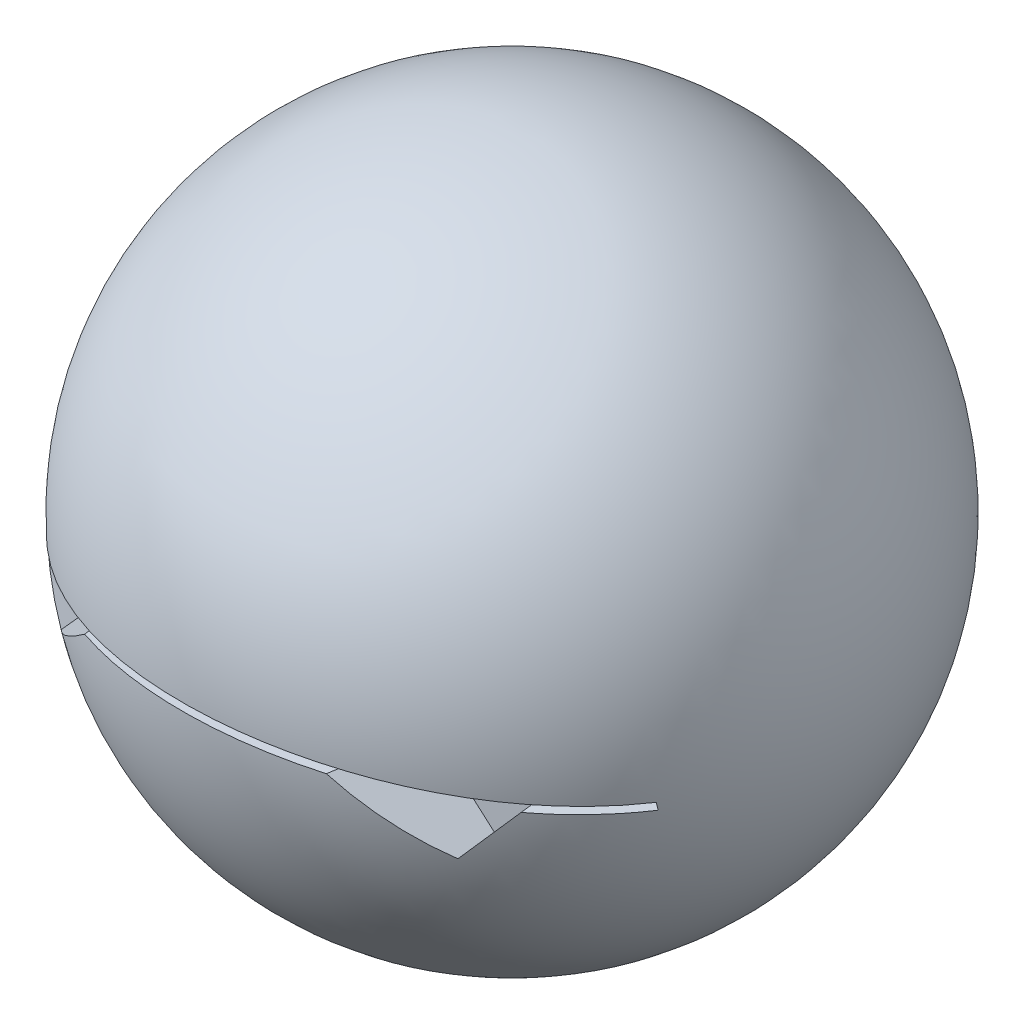
ISO-10303-21;
HEADER;
FILE_DESCRIPTION(('STEP AP214'),'2;1');
FILE_NAME('part.step','',(''),(''),'','','');
FILE_SCHEMA(('AUTOMOTIVE_DESIGN { 1 0 10303 214 1 1 1 1 }'));
ENDSEC;
DATA;
#1=APPLICATION_CONTEXT('core data for automotive mechanical design processes');
#2=APPLICATION_PROTOCOL_DEFINITION('international standard','automotive_design',2000,#1);
#3=PRODUCT_CONTEXT('',#1,'mechanical');
#4=PRODUCT('Part','Part','',(#3));
#5=PRODUCT_RELATED_PRODUCT_CATEGORY('part','',(#4));
#6=PRODUCT_DEFINITION_FORMATION('','',#4);
#7=PRODUCT_DEFINITION_CONTEXT('part definition',#1,'design');
#8=PRODUCT_DEFINITION('design','',#6,#7);
#9=PRODUCT_DEFINITION_SHAPE('','',#8);
#10=(LENGTH_UNIT() NAMED_UNIT(*) SI_UNIT(.MILLI.,.METRE.));
#11=(NAMED_UNIT(*) PLANE_ANGLE_UNIT() SI_UNIT($,.RADIAN.));
#12=(NAMED_UNIT(*) SI_UNIT($,.STERADIAN.) SOLID_ANGLE_UNIT());
#13=UNCERTAINTY_MEASURE_WITH_UNIT(LENGTH_MEASURE(1.E-05),#10,'distance_accuracy_value','');
#14=(GEOMETRIC_REPRESENTATION_CONTEXT(3) GLOBAL_UNCERTAINTY_ASSIGNED_CONTEXT((#13)) GLOBAL_UNIT_ASSIGNED_CONTEXT((#10,
#11,#12)) REPRESENTATION_CONTEXT('',''));
#15=CARTESIAN_POINT('',(0.,0.,0.));
#16=DIRECTION('',(0.,0.,1.));
#17=DIRECTION('',(1.,0.,0.));
#18=AXIS2_PLACEMENT_3D('',#15,#16,#17);
#19=CARTESIAN_POINT('',(0.,0.,0.));
#20=DIRECTION('',(0.,-1.,0.));
#21=DIRECTION('',(-1.,0.,0.));
#22=AXIS2_PLACEMENT_3D('',#19,#20,#21);
#23=SPHERICAL_SURFACE('',#22,10.6989168957846);
#24=CARTESIAN_POINT('',(-2.05987281107311,2.3426779643705,0.272919985495077));
#25=DIRECTION('',(0.657810912927894,-0.748123438570852,-0.0871557427476584));
#26=DIRECTION('',(0.750981148568563,0.66032364374952,0.));
#27=AXIS2_PLACEMENT_3D('',#24,#25,#26);
#28=CIRCLE('',#27,10.2304018191798);
#29=CARTESIAN_POINT('',(-6.43799215854128,-2.42954005131271,8.19246085425697));
#30=VERTEX_POINT('',#29);
#31=CARTESIAN_POINT('',(-3.92068961430644,-0.420381871717587,9.94576768143641));
#32=VERTEX_POINT('',#31);
#33=EDGE_CURVE('E168',#30,#32,#28,.F.);
#34=ORIENTED_EDGE('',*,*,#33,.F.);
#35=CARTESIAN_POINT('',(-4.26473061345468,-3.7498976687421,-0.49683748038208));
#36=DIRECTION('',(-0.748123438570851,-0.657810912927894,-0.0871557427476584));
#37=DIRECTION('',(0.66032364374952,-0.750981148568562,0.));
#38=AXIS2_PLACEMENT_3D('',#35,#36,#37);
#39=CIRCLE('',#38,9.05374593909156);
#40=CARTESIAN_POINT('',(-7.68515836910219,-0.904600032485841,7.38829224963046));
#41=VERTEX_POINT('',#40);
#42=EDGE_CURVE('E158',#41,#30,#39,.F.);
#43=ORIENTED_EDGE('',*,*,#42,.F.);
#44=CARTESIAN_POINT('',(-9.49885623666594,-1.25,4.76193793933279));
#45=CARTESIAN_POINT('',(-9.36781980852261,-1.22242105430566,5.03063372873416));
#46=CARTESIAN_POINT('',(-9.22555920241741,-1.19303155910275,5.29366291933021));
#47=CARTESIAN_POINT('',(-8.91962577674889,-1.13150664198089,5.80661073565107));
#48=CARTESIAN_POINT('',(-8.75595364790619,-1.09937130865234,6.0565297839356));
#49=CARTESIAN_POINT('',(-8.40827615389335,-1.0332377767382,6.54142579426612));
#50=CARTESIAN_POINT('',(-8.22427681653562,-0.999240131900447,6.77640715353196));
#51=CARTESIAN_POINT('',(-7.83711746906592,-0.930325683336183,7.22986573900631));
#52=CARTESIAN_POINT('',(-7.63395776014078,-0.895408894064155,7.44834322454628));
#53=CARTESIAN_POINT('',(-7.2096750727057,-0.825611552362966,7.86739847999027));
#54=CARTESIAN_POINT('',(-6.98854053874256,-0.790731038079567,8.06796455856155));
#55=CARTESIAN_POINT('',(-6.52990534793831,-0.722017752771338,8.4496170706275));
#56=CARTESIAN_POINT('',(-6.29240485170459,-0.688184971469302,8.63070369523915));
#57=CARTESIAN_POINT('',(-5.80272960306486,-0.622544592245537,8.97205181384435));
#58=CARTESIAN_POINT('',(-5.55055955442582,-0.5907363519344,9.13231993054702));
#59=CARTESIAN_POINT('',(-5.03322494044169,-0.53005169505107,9.43094031360318));
#60=CARTESIAN_POINT('',(-4.76806053554704,-0.501175242291555,9.56929285047449));
#61=CARTESIAN_POINT('',(-4.2286101297648,-0.447395300224974,9.8221337795234));
#62=CARTESIAN_POINT('',(-3.95440604002132,-0.422464021912274,9.93679100775286));
#63=CARTESIAN_POINT('',(-3.39698053708135,-0.377042299909343,10.1426809974599));
#64=CARTESIAN_POINT('',(-3.11375913954184,-0.356551848508872,10.2339137996074));
#65=CARTESIAN_POINT('',(-2.54031843403355,-0.32060997844155,10.3922867624067));
#66=CARTESIAN_POINT('',(-2.25009854135497,-0.305158982388186,10.4594249025048));
#67=CARTESIAN_POINT('',(-1.66480993106748,-0.27975414846097,10.5690952369534));
#68=CARTESIAN_POINT('',(-1.36974127505114,-0.269800240814545,10.6116277436147));
#69=CARTESIAN_POINT('',(-0.781768941541474,-0.255799049655385,10.6712776878949));
#70=CARTESIAN_POINT('',(-0.488908274127706,-0.251658205921752,10.6887977760207));
#71=CARTESIAN_POINT('',(0.0972827560163124,-0.249099630727279,10.6995907096983));
#72=CARTESIAN_POINT('',(0.390613113430196,-0.250681834939282,10.6928638277865));
#73=CARTESIAN_POINT('',(0.97560155224967,-0.259523185070276,10.6552142893899));
#74=CARTESIAN_POINT('',(1.26725979066137,-0.266781788900685,10.6242939433486));
#75=CARTESIAN_POINT('',(1.84683812617618,-0.286766528038753,10.5384863418265));
#76=CARTESIAN_POINT('',(2.13475822758706,-0.299492657045161,10.4835991139674));
#77=CARTESIAN_POINT('',(2.70303726120361,-0.329952989614513,10.3506713857766));
#78=CARTESIAN_POINT('',(2.98343205513638,-0.347655588978129,10.2727768452347));
#79=CARTESIAN_POINT('',(3.53655729481621,-0.387603218381634,10.0942657563653));
#80=CARTESIAN_POINT('',(3.80928776236259,-0.40984823550023,9.99364927267206));
#81=CARTESIAN_POINT('',(4.34524621270442,-0.458263238561614,9.77039001818354));
#82=CARTESIAN_POINT('',(4.60847328405635,-0.484433599738779,9.64774514141229));
#83=CARTESIAN_POINT('',(5.12362794394266,-0.539974767751007,9.38128752335455));
#84=CARTESIAN_POINT('',(5.37555557311202,-0.569345563075387,9.2374748581995));
#85=CARTESIAN_POINT('',(5.86920081835536,-0.630827012087236,8.92794121161869));
#86=CARTESIAN_POINT('',(6.11077272894485,-0.662964635270421,8.76199318989608));
#87=CARTESIAN_POINT('',(6.57907159349269,-0.728802179348178,8.41060495886982));
#88=CARTESIAN_POINT('',(6.80579820558931,-0.762502136190108,8.22516430094026));
#89=CARTESIAN_POINT('',(7.2428708702173,-0.830531090186016,7.83610692303054));
#90=CARTESIAN_POINT('',(7.45322169113103,-0.864859900603544,7.63249553143782));
#91=CARTESIAN_POINT('',(7.85619724303386,-0.933211121384213,7.20852611289298));
#92=CARTESIAN_POINT('',(8.04882584599551,-0.967233597203306,6.98817176326477));
#93=CARTESIAN_POINT('',(8.47998151735123,-1.04588099502691,6.4514671654121));
#94=CARTESIAN_POINT('',(8.71070588028409,-1.09000883465036,6.12868956220095));
#95=CARTESIAN_POINT('',(9.02858997046031,-1.15286010969082,5.62689674596293));
#96=CARTESIAN_POINT('',(9.12979723560146,-1.17324225597793,5.45680495245038));
#97=CARTESIAN_POINT('',(9.32268061146251,-1.21267726864895,5.1111059236891));
#98=CARTESIAN_POINT('',(9.41435481118384,-1.23172986826108,4.93549759174627));
#99=CARTESIAN_POINT('',(9.50114376333407,-1.25,4.75737216658132));
#100=B_SPLINE_CURVE_WITH_KNOTS('',3,(#44,#45,#46,#47,#48,#49,#50,#51,#52,#53,#54,#55,#56,#57,
#58,#59,#60,#61,#62,#63,#64,#65,#66,#67,#68,#69,#70,#71,#72,#73,#74,#75,#76,#77,#78,#79,#80,#81,
#82,#83,#84,#85,#86,#87,#88,#89,#90,#91,#92,#93,#94,#95,#96,#97,#98,#99),.UNSPECIFIED.,.F.,.F.,
(4,2,2,2,2,2,2,2,2,2,2,2,2,2,2,2,2,2,2,2,2,2,2,2,2,2,2,4),(0.,0.900368641115499,
1.80070824413359,2.70078157428351,3.60084075830599,4.50148320926315,5.40211682302352,
6.30246322511677,7.20279851280092,8.09647884773205,8.99015763102772,9.88391133981222,
10.7776537042405,11.6568397715412,12.5360159568061,13.4151081921711,14.2941994143964,
15.1678292195782,16.0414565396807,16.9151674254956,17.7888751690248,18.6723547424181,
19.5558546536776,20.4390963333473,21.3221445807103,22.5169246009654,23.1135798389274,
23.7103544527818),.UNSPECIFIED.);
#101=CARTESIAN_POINT('',(-9.49885623666594,-1.25,4.76193793933279));
#102=VERTEX_POINT('',#101);
#103=EDGE_CURVE('E225',#102,#41,#100,.T.);
#104=ORIENTED_EDGE('',*,*,#103,.F.);
#105=CARTESIAN_POINT('',(-9.50437611616549,-0.0434830276592548,0.));
#106=DIRECTION('',(0.999989534607774,0.00457500545652418,0.));
#107=DIRECTION('',(-0.00457500545652418,0.999989534607774,0.));
#108=AXIS2_PLACEMENT_3D('',#105,#106,#107);
#109=CIRCLE('',#108,4.91240945073525);
#110=CARTESIAN_POINT('',(-9.5,-1.,4.81838383100645));
#111=VERTEX_POINT('',#110);
#112=EDGE_CURVE('E334',#111,#102,#109,.T.);
#113=ORIENTED_EDGE('',*,*,#112,.F.);
#114=CARTESIAN_POINT('',(9.5,-1.,4.81838383100645));
#115=CARTESIAN_POINT('',(9.36702203141971,-0.972013364668374,5.08644492593927));
#116=CARTESIAN_POINT('',(9.22282288733641,-0.942234616776767,5.34874384973268));
#117=CARTESIAN_POINT('',(8.91304801090235,-0.879980414327547,5.86004779522866));
#118=CARTESIAN_POINT('',(8.74747322181953,-0.847505078787944,6.10905340285589));
#119=CARTESIAN_POINT('',(8.39606985200478,-0.780755691646606,6.59193036557801));
#120=CARTESIAN_POINT('',(8.21024924366356,-0.746482350799607,6.82580762050513));
#121=CARTESIAN_POINT('',(7.81953843482809,-0.677086031473853,7.27691023871035));
#122=CARTESIAN_POINT('',(7.61464847680887,-0.641963063802673,7.49413581365771));
#123=CARTESIAN_POINT('',(7.18703228599639,-0.57183058389374,7.91054667522528));
#124=CARTESIAN_POINT('',(6.9642956520569,-0.536821150372893,8.10972129542174));
#125=CARTESIAN_POINT('',(6.50259318083694,-0.467927297425953,8.48849176175001));
#126=CARTESIAN_POINT('',(6.26362747282827,-0.434042869041894,8.66808776380455));
#127=CARTESIAN_POINT('',(5.77116802133688,-0.368374319730673,9.00638860886082));
#128=CARTESIAN_POINT('',(5.51767850322128,-0.336589593679118,9.16509948405428));
#129=CARTESIAN_POINT('',(4.99786789304762,-0.276023791423641,9.46056237802128));
#130=CARTESIAN_POINT('',(4.73154693742718,-0.247242683292329,9.59731463021549));
#131=CARTESIAN_POINT('',(4.18950196558698,-0.193672059139736,9.84716465219462));
#132=CARTESIAN_POINT('',(3.91384028651545,-0.168860700543355,9.96039296384067));
#133=CARTESIAN_POINT('',(3.35363962540074,-0.123750181838313,10.1633593098815));
#134=CARTESIAN_POINT('',(3.06910065093136,-0.103451017880131,10.2530973643168));
#135=CARTESIAN_POINT('',(2.49316896596678,-0.0679553161461518,10.4084385793147));
#136=CARTESIAN_POINT('',(2.20177564840543,-0.0527592321676142,10.4740395935128));
#137=CARTESIAN_POINT('',(1.61428709815736,-0.0279185234302613,10.5806142195426));
#138=CARTESIAN_POINT('',(1.31819191871036,-0.0182738358583531,10.6215881100262));
#139=CARTESIAN_POINT('',(0.727738701458111,-0.00491626990129128,10.6781991964215));
#140=CARTESIAN_POINT('',(0.433416449194735,-0.00112047324322581,10.694190608774));
#141=CARTESIAN_POINT('',(-0.155560311548282,0.000692750067804957,10.7018390873452));
#142=CARTESIAN_POINT('',(-0.450214816753195,-0.00128976681649187,10.6934963913444));
#143=CARTESIAN_POINT('',(-1.03770801224854,-0.0109756866179867,10.6525389826037));
#144=CARTESIAN_POINT('',(-1.33054687340561,-0.0186785427054638,10.619926589899));
#145=CARTESIAN_POINT('',(-1.91233819686573,-0.0395835269839912,10.530666615153));
#146=CARTESIAN_POINT('',(-2.20129066349351,-0.0527856490550027,10.4740190598601));
#147=CARTESIAN_POINT('',(-2.77170599332417,-0.0842265030664447,10.3374639583064));
#148=CARTESIAN_POINT('',(-3.05320090867544,-0.102437611841702,10.2576838545015));
#149=CARTESIAN_POINT('',(-3.60835617543864,-0.143414702755469,10.0753066984677));
#150=CARTESIAN_POINT('',(-3.8820165393253,-0.166180677640939,9.97270968257172));
#151=CARTESIAN_POINT('',(-4.41966195107892,-0.215635753130581,9.74539472500729));
#152=CARTESIAN_POINT('',(-4.68364575599576,-0.242325355532302,9.62067395348232));
#153=CARTESIAN_POINT('',(-5.20011818742184,-0.298886775707987,9.34997681848406));
#154=CARTESIAN_POINT('',(-5.45260688595461,-0.328758573539725,9.20400058821266));
#155=CARTESIAN_POINT('',(-5.94698051692709,-0.391189272460126,8.89015267614218));
#156=CARTESIAN_POINT('',(-6.18872762198305,-0.423772919618392,8.72206878621629));
#157=CARTESIAN_POINT('',(-6.65716889282842,-0.490449004265922,8.36636098299381));
#158=CARTESIAN_POINT('',(-6.88386281694267,-0.524541465964201,8.17873675610601));
#159=CARTESIAN_POINT('',(-7.32062291457097,-0.593283547312277,7.78529604714298));
#160=CARTESIAN_POINT('',(-7.53069579759315,-0.627932935278235,7.5794869775979));
#161=CARTESIAN_POINT('',(-7.93288016850425,-0.696843694426163,7.15109604464681));
#162=CARTESIAN_POINT('',(-8.12499615149949,-0.731105160818042,6.92851840420748));
#163=CARTESIAN_POINT('',(-8.53846503837508,-0.807225020908069,6.40699636397911));
#164=CARTESIAN_POINT('',(-8.7541139782451,-0.848696348652013,6.10342262772405));
#165=CARTESIAN_POINT('',(-9.05274858201135,-0.907948613606831,5.63250763164991));
#166=CARTESIAN_POINT('',(-9.14810201077938,-0.927195851719273,5.47304764574777));
#167=CARTESIAN_POINT('',(-9.33040141970063,-0.964522093009029,5.14926872882854));
#168=CARTESIAN_POINT('',(-9.41734776872691,-0.982601147430572,4.98495001140895));
#169=CARTESIAN_POINT('',(-9.5,-1.,4.81838383100645));
#170=B_SPLINE_CURVE_WITH_KNOTS('',3,(#114,#115,#116,#117,#118,#119,#120,#121,#122,#123,#124,
#125,#126,#127,#128,#129,#130,#131,#132,#133,#134,#135,#136,#137,#138,#139,#140,#141,#142,#143,
#144,#145,#146,#147,#148,#149,#150,#151,#152,#153,#154,#155,#156,#157,#158,#159,#160,#161,#162,
#163,#164,#165,#166,#167,#168,#169),.UNSPECIFIED.,.F.,.F.,(4,2,2,2,2,2,2,2,2,2,2,2,2,2,2,2,2,2,
2,2,2,2,2,2,2,2,2,4),(0.,0.901337028787135,1.80263429681349,2.70357792638866,3.60451010164147,
4.50597121888988,5.4074251564409,6.30861815546356,7.20980157414883,8.10584195006694,
9.0018815615366,9.89800083327272,10.7941099653745,11.6773943363593,12.5606700763679,
13.443861391442,14.3270517236302,15.2054659221747,16.0838787219681,16.962403960944,
17.8409236946895,18.7285932750932,19.6162771033727,20.5036007474811,21.3907016718178,
22.512399702461,23.0725518618863,23.6326794326437),.UNSPECIFIED.);
#171=CARTESIAN_POINT('',(9.5,-1.,4.81838383100645));
#172=VERTEX_POINT('',#171);
#173=EDGE_CURVE('E218',#172,#111,#170,.T.);
#174=ORIENTED_EDGE('',*,*,#173,.F.);
#175=CARTESIAN_POINT('',(9.49522620101089,0.0434411663094004,0.));
#176=DIRECTION('',(-0.999989534607774,-0.00457500545652418,0.));
#177=DIRECTION('',(0.00457500545652418,-0.999989534607774,0.));
#178=AXIS2_PLACEMENT_3D('',#175,#176,#177);
#179=CIRCLE('',#178,4.93007251464016);
#180=CARTESIAN_POINT('',(9.50114376333406,-1.25,4.75737216658132));
#181=VERTEX_POINT('',#180);
#182=EDGE_CURVE('E335',#181,#172,#179,.T.);
#183=ORIENTED_EDGE('',*,*,#182,.F.);
#184=CARTESIAN_POINT('',(7.68543176464898,-0.904256985830277,7.38804985347324));
#185=VERTEX_POINT('',#184);
#186=EDGE_CURVE('E382',#185,#181,#100,.T.);
#187=ORIENTED_EDGE('',*,*,#186,.F.);
#188=CARTESIAN_POINT('',(4.26473061345469,-3.7498976687421,-0.49683748038208));
#189=DIRECTION('',(0.748123438570852,-0.657810912927894,-0.0871557427476584));
#190=DIRECTION('',(0.660323643749519,0.750981148568563,0.));
#191=AXIS2_PLACEMENT_3D('',#188,#189,#190);
#192=CIRCLE('',#191,9.05374593909156);
#193=CARTESIAN_POINT('',(6.43799215854128,-2.42954005131271,8.19246085425697));
#194=VERTEX_POINT('',#193);
#195=EDGE_CURVE('E184',#185,#194,#192,.T.);
#196=ORIENTED_EDGE('',*,*,#195,.T.);
#197=CARTESIAN_POINT('',(2.05987281107311,2.3426779643705,0.272919985495077));
#198=DIRECTION('',(-0.657810912927894,-0.748123438570852,-0.0871557427476584));
#199=DIRECTION('',(0.750981148568563,-0.66032364374952,0.));
#200=AXIS2_PLACEMENT_3D('',#197,#198,#199);
#201=CIRCLE('',#200,10.2304018191798);
#202=CARTESIAN_POINT('',(3.92042189054046,-0.420159854830957,9.94588259730949));
#203=VERTEX_POINT('',#202);
#204=EDGE_CURVE('E177',#194,#203,#201,.T.);
#205=ORIENTED_EDGE('',*,*,#204,.T.);
#206=EDGE_CURVE('E320',#32,#203,#100,.T.);
#207=ORIENTED_EDGE('',*,*,#206,.F.);
#208=EDGE_LOOP('',(#34,#43,#104,#113,#174,#183,#187,#196,#205,#207));
#209=FACE_BOUND('',#208,.T.);
#210=ADVANCED_FACE('F35',(#209),#23,.T.);
#211=CARTESIAN_POINT('',(-9.49885623666594,-1.25,10.6989168957846));
#212=CARTESIAN_POINT('',(0.00114376333405997,0.750101860799738,10.6989168957846));
#213=CARTESIAN_POINT('',(9.50114376333407,-1.25,10.6989168957846));
#214=B_SPLINE_CURVE_WITH_KNOTS('',2,(#211,#212,#213),.UNSPECIFIED.,.F.,.F.,(3,3),(0.,1.),.UNSPECIFIED.);
#215=DIRECTION('',(0.,0.,-1.));
#216=VECTOR('',#215,1.);
#217=SURFACE_OF_LINEAR_EXTRUSION('',#214,#216);
#218=CARTESIAN_POINT('',(-7.18208988136592,-0.821710549314133,7.));
#219=CARTESIAN_POINT('',(-7.10827647132993,-0.809960348733506,7.05896990064517));
#220=CARTESIAN_POINT('',(-7.03345076809849,-0.798229332606935,7.11669547248533));
#221=CARTESIAN_POINT('',(-6.88157416271256,-0.774807038018427,7.22943906353353));
#222=CARTESIAN_POINT('',(-6.80451955784224,-0.763115866583542,7.28445211170075));
#223=CARTESIAN_POINT('',(-6.64819994874277,-0.739809610911961,7.39137181340312));
#224=CARTESIAN_POINT('',(-6.56893368892991,-0.728194574716487,7.44327664751031));
#225=CARTESIAN_POINT('',(-6.40717364827289,-0.704929663353911,7.54421201275847));
#226=CARTESIAN_POINT('',(-6.32465172563338,-0.693281205725461,7.59319788474297));
#227=CARTESIAN_POINT('',(-6.15736657876468,-0.670139537268104,7.68713068129871));
#228=CARTESIAN_POINT('',(-6.07260450493948,-0.658646251164441,7.7320796287578));
#229=CARTESIAN_POINT('',(-5.90085344563366,-0.635854570005715,7.81750180867253));
#230=CARTESIAN_POINT('',(-5.81386504514739,-0.624556125033682,7.85797620229977));
#231=CARTESIAN_POINT('',(-5.61347547319339,-0.59912298880347,7.94444760799599));
#232=CARTESIAN_POINT('',(-5.49939116552133,-0.585063070711194,7.98890099751813));
#233=CARTESIAN_POINT('',(-5.26804105405485,-0.557454296566942,8.06876501601556));
#234=CARTESIAN_POINT('',(-5.15077571989905,-0.543905365772538,8.10417697189335));
#235=CARTESIAN_POINT('',(-4.9143230205461,-0.517529768210187,8.16482999185827));
#236=CARTESIAN_POINT('',(-4.79515191310716,-0.504699171642765,8.19013227334601));
#237=CARTESIAN_POINT('',(-4.55500156962442,-0.479811752139415,8.23009494085357));
#238=CARTESIAN_POINT('',(-4.43402328433577,-0.467754538857167,8.24476073452672));
#239=CARTESIAN_POINT('',(-4.20743138724744,-0.446092712066403,8.26174078752864));
#240=CARTESIAN_POINT('',(-4.10193130818841,-0.436375954664347,8.26544686920137));
#241=CARTESIAN_POINT('',(-3.89058106753595,-0.417650052713106,8.26444804322569));
#242=CARTESIAN_POINT('',(-3.78473082935846,-0.408643181973141,8.2597171705669));
#243=CARTESIAN_POINT('',(-3.67919925209644,-0.400038981618522,8.25072483012035));
#244=B_SPLINE_CURVE_WITH_KNOTS('',3,(#218,#219,#220,#221,#222,#223,#224,#225,#226,#227,#228,
#229,#230,#231,#232,#233,#234,#235,#236,#237,#238,#239,#240,#241,#242,#243),.UNSPECIFIED.,.F.,
.F.,(4,2,2,2,2,2,2,2,2,2,2,2,4),(0.,0.28561807376653,0.571741478104748,0.858030762959491,
1.14794114800902,1.43770543991379,1.7273943589839,2.09677310780265,2.4660976161436,
2.83315055930162,3.20001675950604,3.51772046084113,3.83640359388204),.UNSPECIFIED.);
#245=CARTESIAN_POINT('',(-7.18208988136592,-0.821710549314133,7.));
#246=VERTEX_POINT('',#245);
#247=CARTESIAN_POINT('',(-4.16910905858596,-0.442657040010966,8.2620180935632));
#248=VERTEX_POINT('',#247);
#249=EDGE_CURVE('E49',#246,#248,#244,.T.);
#250=ORIENTED_EDGE('',*,*,#249,.T.);
#251=CARTESIAN_POINT('',(-4.35645211994245,-0.460360249445809,7.));
#252=CARTESIAN_POINT('',(-4.28204524166265,-0.453176838957555,7.49992780051644));
#253=CARTESIAN_POINT('',(-4.20786386714101,-0.446195915285011,7.99989170077466));
#254=CARTESIAN_POINT('',(-4.05995212561406,-0.432639041571347,8.99989170077466));
#255=CARTESIAN_POINT('',(-3.98622175860875,-0.426063091530225,9.49992780051644));
#256=CARTESIAN_POINT('',(-3.91271689536161,-0.419689628304815,10.));
#257=B_SPLINE_CURVE_WITH_KNOTS('',3,(#251,#252,#253,#254,#255,#256),.UNSPECIFIED.,.F.,.F.,(4,2,
4),(0.,1.51645626400628,3.03291252801255),.UNSPECIFIED.);
#258=EDGE_CURVE('E11',#248,#32,#257,.T.);
#259=ORIENTED_EDGE('',*,*,#258,.T.);
#260=ORIENTED_EDGE('',*,*,#206,.T.);
#261=CARTESIAN_POINT('',(4.35616997403028,-0.460112163835205,7.));
#262=CARTESIAN_POINT('',(4.28176850472127,-0.452933512129947,7.49992782434832));
#263=CARTESIAN_POINT('',(4.20759249156211,-0.445957303991109,7.99989173652247));
#264=CARTESIAN_POINT('',(4.0596913775435,-0.432409774846274,8.99989173652247));
#265=CARTESIAN_POINT('',(3.98596627668406,-0.425838453840276,9.49992782434832));
#266=CARTESIAN_POINT('',(3.91246663197446,-0.419469576400698,10.));
#267=B_SPLINE_CURVE_WITH_KNOTS('',3,(#261,#262,#263,#264,#265,#266),.UNSPECIFIED.,.F.,.F.,(4,2,
4),(0.,1.51645374375945,3.0329074875189),.UNSPECIFIED.);
#268=CARTESIAN_POINT('',(4.16848068873395,-0.442387646247772,8.26444832651036));
#269=VERTEX_POINT('',#268);
#270=EDGE_CURVE('E264',#269,#203,#267,.T.);
#271=ORIENTED_EDGE('',*,*,#270,.F.);
#272=CARTESIAN_POINT('',(7.18727770656233,-0.822172350735252,7.));
#273=CARTESIAN_POINT('',(7.11347014108275,-0.810418337409004,7.05901923208027));
#274=CARTESIAN_POINT('',(7.03865027240375,-0.798683411465766,7.11679523037222));
#275=CARTESIAN_POINT('',(6.88678521850516,-0.775253078102809,7.22964205005139));
#276=CARTESIAN_POINT('',(6.80973633385604,-0.76355777718951,7.2847079096557));
#277=CARTESIAN_POINT('',(6.65342771148934,-0.740242993559443,7.39173583701175));
#278=CARTESIAN_POINT('',(6.5741667191374,-0.728623558678176,7.44369608863978));
#279=CARTESIAN_POINT('',(6.41241512939238,-0.705349286552054,7.54474659111703));
#280=CARTESIAN_POINT('',(6.32989634315416,-0.693695864621331,7.59379216045317));
#281=CARTESIAN_POINT('',(6.16261603330814,-0.670543893572173,7.68784715447232));
#282=CARTESIAN_POINT('',(6.07785565933489,-0.659045269460534,7.7328585980579));
#283=CARTESIAN_POINT('',(5.90610601818167,-0.636242493290637,7.81840853228834));
#284=CARTESIAN_POINT('',(5.8191173350352,-0.624938291547178,7.85894818049232));
#285=CARTESIAN_POINT('',(5.61870667439778,-0.599489317626683,7.94557852641329));
#286=CARTESIAN_POINT('',(5.50460020487763,-0.585419237754561,7.99012514812169));
#287=CARTESIAN_POINT('',(5.27319926868894,-0.557789545927655,8.07017580660754));
#288=CARTESIAN_POINT('',(5.15590527319563,-0.544229859226509,8.10568117188958));
#289=CARTESIAN_POINT('',(4.91938887488193,-0.517832432127197,8.16651816587991));
#290=CARTESIAN_POINT('',(4.80018280172654,-0.5049907590892,8.19191111720066));
#291=CARTESIAN_POINT('',(4.55995446724285,-0.480080852336278,8.23205076248118));
#292=CARTESIAN_POINT('',(4.43893315713374,-0.468012229878853,8.24680284630505));
#293=CARTESIAN_POINT('',(4.21149596103148,-0.446256636023645,8.26399376842388));
#294=CARTESIAN_POINT('',(4.10518974099599,-0.436462388031367,8.26776509588753));
#295=CARTESIAN_POINT('',(3.89221887952497,-0.417592073962153,8.2667679812939));
#296=CARTESIAN_POINT('',(3.78555415800005,-0.408518352504623,8.26197276449736));
#297=CARTESIAN_POINT('',(3.67921573578758,-0.39985380568731,8.25284976991652));
#298=B_SPLINE_CURVE_WITH_KNOTS('',3,(#272,#273,#274,#275,#276,#277,#278,#279,#280,#281,#282,
#283,#284,#285,#286,#287,#288,#289,#290,#291,#292,#293,#294,#295,#296,#297),.UNSPECIFIED.,.F.,
.F.,(4,2,2,2,2,2,2,2,2,2,2,2,4),(0.,0.285697586693317,0.57190013280069,0.858268441494468,
1.14826349627,1.43811260128163,1.72788649964062,2.09743128765746,2.46692174411021,
2.83413615196718,3.2011644257248,3.52129508658399,3.84242806719495),.UNSPECIFIED.);
#299=CARTESIAN_POINT('',(7.1872777065751,-0.822172350736835,7.));
#300=VERTEX_POINT('',#299);
#301=EDGE_CURVE('E257',#300,#269,#298,.T.);
#302=ORIENTED_EDGE('',*,*,#301,.F.);
#303=CARTESIAN_POINT('',(-9.49885623666594,-1.25,7.));
#304=CARTESIAN_POINT('',(0.00114376333405997,0.750101860799738,7.));
#305=CARTESIAN_POINT('',(9.50114376333407,-1.25,7.));
#306=B_SPLINE_CURVE_WITH_KNOTS('',2,(#303,#304,#305),.UNSPECIFIED.,.F.,.F.,(3,3),(0.,1.),.UNSPECIFIED.);
#307=CARTESIAN_POINT('',(7.64609890884292,-0.89757583770359,7.));
#308=VERTEX_POINT('',#307);
#309=EDGE_CURVE('E331',#308,#300,#306,.F.);
#310=ORIENTED_EDGE('',*,*,#309,.F.);
#311=CARTESIAN_POINT('',(7.94950075508411,-0.949999999977305,10.));
#312=CARTESIAN_POINT('',(7.89906248979555,-0.941114874696536,9.49998956509583));
#313=CARTESIAN_POINT('',(7.84855986902222,-0.932303631707028,8.99998434764375));
#314=CARTESIAN_POINT('',(7.74742591650603,-0.914828910310536,7.99998434764375));
#315=CARTESIAN_POINT('',(7.69679458476317,-0.906165431903551,7.49998956509583));
#316=CARTESIAN_POINT('',(7.64609889753555,-0.897575835787828,7.));
#317=B_SPLINE_CURVE_WITH_KNOTS('',3,(#311,#312,#313,#314,#315,#316),.UNSPECIFIED.,.F.,.F.,(4,2,
4),(0.,1.50787941549904,3.01575883099807),.UNSPECIFIED.);
#318=EDGE_CURVE('E249',#185,#308,#317,.T.);
#319=ORIENTED_EDGE('',*,*,#318,.F.);
#320=ORIENTED_EDGE('',*,*,#186,.T.);
#321=DIRECTION('',(0.,0.,-1.));
#322=VECTOR('',#321,1.);
#323=CARTESIAN_POINT('',(9.50114376333407,-1.25,10.6989168957846));
#324=LINE('',#323,#322);
#325=CARTESIAN_POINT('',(9.50114376333407,-1.25,0.));
#326=VERTEX_POINT('',#325);
#327=EDGE_CURVE('E379',#181,#326,#324,.T.);
#328=ORIENTED_EDGE('',*,*,#327,.T.);
#329=CARTESIAN_POINT('',(-9.49885623666594,-1.25,0.));
#330=CARTESIAN_POINT('',(0.00114376333405997,0.750101860799738,0.));
#331=CARTESIAN_POINT('',(9.50114376333407,-1.25,0.));
#332=B_SPLINE_CURVE_WITH_KNOTS('',2,(#329,#330,#331),.UNSPECIFIED.,.F.,.F.,(3,3),(0.,1.),.UNSPECIFIED.);
#333=CARTESIAN_POINT('',(0.650883948757439,-0.254627006546936,0.));
#334=VERTEX_POINT('',#333);
#335=EDGE_CURVE('E365',#334,#326,#332,.T.);
#336=ORIENTED_EDGE('',*,*,#335,.F.);
#337=CARTESIAN_POINT('',(-0.650871111876112,-0.254659818067721,0.));
#338=CARTESIAN_POINT('',(-0.650901837798949,-0.254661543008802,0.036787775984723));
#339=CARTESIAN_POINT('',(-0.64777155112324,-0.25461505194864,0.0735668395804572));
#340=CARTESIAN_POINT('',(-0.635414664502925,-0.254438361166256,0.146062581319558));
#341=CARTESIAN_POINT('',(-0.626192044665461,-0.254308216096502,0.181779937165157));
#342=CARTESIAN_POINT('',(-0.601869701612136,-0.253976828583242,0.251174994344906));
#343=CARTESIAN_POINT('',(-0.586767099092371,-0.253775551312256,0.284851687058277));
#344=CARTESIAN_POINT('',(-0.551121663441803,-0.253325181685598,0.349180898806063));
#345=CARTESIAN_POINT('',(-0.530580012429823,-0.253076099722995,0.37983407298528));
#346=CARTESIAN_POINT('',(-0.484653807023864,-0.252558340948376,0.437217586386541));
#347=CARTESIAN_POINT('',(-0.45927415109954,-0.252289684124393,0.463951845480207));
#348=CARTESIAN_POINT('',(-0.404376472573534,-0.251762954021131,0.51276605149152));
#349=CARTESIAN_POINT('',(-0.374858536136534,-0.251504880521638,0.534846095292364));
#350=CARTESIAN_POINT('',(-0.312603401071834,-0.25102915086128,0.573664143674016));
#351=CARTESIAN_POINT('',(-0.279874733369033,-0.250811391808331,0.590415828311085));
#352=CARTESIAN_POINT('',(-0.21206648252479,-0.250440068666951,0.618170172908173));
#353=CARTESIAN_POINT('',(-0.176987085691456,-0.250286499498088,0.629173287867124));
#354=CARTESIAN_POINT('',(-0.105564653244737,-0.250061155094638,0.645093582259988));
#355=CARTESIAN_POINT('',(-0.0692249640959843,-0.249989178131017,0.650025774084369));
#356=CARTESIAN_POINT('',(0.00376716823349571,-0.249934388562161,0.653711551176263));
#357=CARTESIAN_POINT('',(0.040419615622711,-0.249951577158636,0.652465053171777));
#358=CARTESIAN_POINT('',(0.112947625633312,-0.250073023214268,0.643834757531605));
#359=CARTESIAN_POINT('',(0.148824104235387,-0.250177171537869,0.636458652684875));
#360=CARTESIAN_POINT('',(0.218830338002649,-0.250460578642163,0.615791866600242));
#361=CARTESIAN_POINT('',(0.252960097522245,-0.250639837235602,0.602501200107598));
#362=CARTESIAN_POINT('',(0.318528372884403,-0.251053350237847,0.570377388319781));
#363=CARTESIAN_POINT('',(0.349965230061757,-0.251287638213722,0.551540858349093));
#364=CARTESIAN_POINT('',(0.409237369441456,-0.2517847370346,0.508868924246232));
#365=CARTESIAN_POINT('',(0.437072793661656,-0.252047546754132,0.485033717327629));
#366=CARTESIAN_POINT('',(0.488419503722213,-0.252572755589991,0.432986801648619));
#367=CARTESIAN_POINT('',(0.511921316275295,-0.252835152592108,0.404765747696452));
#368=CARTESIAN_POINT('',(0.553868529086484,-0.253329439628316,0.344786600609641));
#369=CARTESIAN_POINT('',(0.57231383998104,-0.253561329123209,0.313028444977748));
#370=CARTESIAN_POINT('',(0.603690547433163,-0.253969394175031,0.246762209327765));
#371=CARTESIAN_POINT('',(0.616602532067273,-0.254145373037946,0.212244944122336));
#372=CARTESIAN_POINT('',(0.636437764017101,-0.254420146677908,0.141577679263934));
#373=CARTESIAN_POINT('',(0.643370028784209,-0.254519057651903,0.105430224880988));
#374=CARTESIAN_POINT('',(0.64967168967695,-0.254609635118134,0.0460612370861696));
#375=CARTESIAN_POINT('',(0.650893618995054,-0.254627487320917,0.0230245819335995));
#376=CARTESIAN_POINT('',(0.650883948757829,-0.25462700654701,0.));
#377=B_SPLINE_CURVE_WITH_KNOTS('',3,(#337,#338,#339,#340,#341,#342,#343,#344,#345,#346,#347,
#348,#349,#350,#351,#352,#353,#354,#355,#356,#357,#358,#359,#360,#361,#362,#363,#364,#365,#366,
#367,#368,#369,#370,#371,#372,#373,#374,#375,#376),.UNSPECIFIED.,.F.,.F.,(4,2,2,2,2,2,2,2,2,2,2,
2,2,2,2,2,2,2,2,4),(0.,0.1102179933089,0.220364052574612,0.33056411602486,0.440740248305368,
0.550805414369359,0.660868289065724,0.77064626324517,0.880415547187962,0.989912840923055,
1.09941161038903,1.20877316371109,1.31813444439159,1.4275626077976,1.53698645472937,
1.64664673791169,1.75630895899522,1.86635280696899,1.97623041662439,2.0453037500106),.UNSPECIFIED.);
#378=CARTESIAN_POINT('',(-0.650871111876112,-0.254659818067721,0.));
#379=VERTEX_POINT('',#378);
#380=EDGE_CURVE('E231',#379,#334,#377,.T.);
#381=ORIENTED_EDGE('',*,*,#380,.F.);
#382=CARTESIAN_POINT('',(-9.49885623666594,-1.25,0.));
#383=VERTEX_POINT('',#382);
#384=EDGE_CURVE('E366',#383,#379,#332,.T.);
#385=ORIENTED_EDGE('',*,*,#384,.F.);
#386=DIRECTION('',(0.,0.,-1.));
#387=VECTOR('',#386,1.);
#388=CARTESIAN_POINT('',(-9.49885623666594,-1.25,10.6989168957846));
#389=LINE('',#388,#387);
#390=EDGE_CURVE('E381',#102,#383,#389,.T.);
#391=ORIENTED_EDGE('',*,*,#390,.F.);
#392=ORIENTED_EDGE('',*,*,#103,.T.);
#393=CARTESIAN_POINT('',(-7.94919393466332,-0.950348944550463,10.));
#394=CARTESIAN_POINT('',(-7.89875735515686,-0.941461902313405,9.49998956714208));
#395=CARTESIAN_POINT('',(-7.84825642658278,-0.932648734933885,8.99998435071312));
#396=CARTESIAN_POINT('',(-7.74712587129938,-0.915170149889919,7.99998435071312));
#397=CARTESIAN_POINT('',(-7.69649624459006,-0.906504732225474,7.49998956714208));
#398=CARTESIAN_POINT('',(-7.64580226881311,-0.897913189418565,7.));
#399=B_SPLINE_CURVE_WITH_KNOTS('',3,(#393,#394,#395,#396,#397,#398),.UNSPECIFIED.,.F.,.F.,(4,2,
4),(0.,1.50787900358765,3.0157580071753),.UNSPECIFIED.);
#400=CARTESIAN_POINT('',(-7.64580227279305,-0.897913184892206,7.));
#401=VERTEX_POINT('',#400);
#402=EDGE_CURVE('E271',#41,#401,#399,.T.);
#403=ORIENTED_EDGE('',*,*,#402,.T.);
#404=CARTESIAN_POINT('',(-9.49885623666594,-1.25,7.));
#405=CARTESIAN_POINT('',(0.00114376333405997,0.750101860799738,7.));
#406=CARTESIAN_POINT('',(9.50114376333407,-1.25,7.));
#407=B_SPLINE_CURVE_WITH_KNOTS('',2,(#404,#405,#406),.UNSPECIFIED.,.F.,.F.,(3,3),(0.,1.),.UNSPECIFIED.);
#408=EDGE_CURVE('E162',#401,#246,#407,.T.);
#409=ORIENTED_EDGE('',*,*,#408,.T.);
#410=EDGE_LOOP('',(#250,#259,#260,#271,#302,#310,#319,#320,#328,#336,#381,#385,#391,#392,#403,#409));
#411=FACE_BOUND('',#410,.T.);
#412=ADVANCED_FACE('F237',(#411),#217,.T.);
#413=CARTESIAN_POINT('',(-9.49885623666594,-1.25,10.6989168957846));
#414=DIRECTION('',(0.999989534607774,0.00457500545652418,0.));
#415=DIRECTION('',(-0.00457500545652418,0.999989534607774,0.));
#416=AXIS2_PLACEMENT_3D('',#413,#414,#415);
#417=PLANE('',#416);
#418=ORIENTED_EDGE('',*,*,#112,.T.);
#419=ORIENTED_EDGE('',*,*,#390,.T.);
#420=DIRECTION('',(0.00457500545652418,-0.999989534607774,0.));
#421=VECTOR('',#420,1.);
#422=CARTESIAN_POINT('',(-9.49885623666594,-1.25,0.));
#423=LINE('',#422,#421);
#424=CARTESIAN_POINT('',(-9.5,-1.,0.));
#425=VERTEX_POINT('',#424);
#426=EDGE_CURVE('E357',#425,#383,#423,.T.);
#427=ORIENTED_EDGE('',*,*,#426,.F.);
#428=DIRECTION('',(0.,0.,-1.));
#429=VECTOR('',#428,1.);
#430=CARTESIAN_POINT('',(-9.5,-1.,10.6989168957846));
#431=LINE('',#430,#429);
#432=EDGE_CURVE('E354',#111,#425,#431,.T.);
#433=ORIENTED_EDGE('',*,*,#432,.F.);
#434=EDGE_LOOP('',(#418,#419,#427,#433));
#435=FACE_BOUND('',#434,.T.);
#436=ADVANCED_FACE('F207',(#435),#417,.T.);
#437=CARTESIAN_POINT('',(9.50114376333406,-1.25,10.6989168957846));
#438=DIRECTION('',(-0.999989534607774,-0.00457500545652418,0.));
#439=DIRECTION('',(0.00457500545652418,-0.999989534607774,0.));
#440=AXIS2_PLACEMENT_3D('',#437,#438,#439);
#441=PLANE('',#440);
#442=ORIENTED_EDGE('',*,*,#182,.T.);
#443=DIRECTION('',(0.,0.,-1.));
#444=VECTOR('',#443,1.);
#445=CARTESIAN_POINT('',(9.5,-1.,10.6989168957846));
#446=LINE('',#445,#444);
#447=CARTESIAN_POINT('',(9.5,-1.,0.));
#448=VERTEX_POINT('',#447);
#449=EDGE_CURVE('E377',#172,#448,#446,.T.);
#450=ORIENTED_EDGE('',*,*,#449,.T.);
#451=DIRECTION('',(-0.00457500545652418,0.999989534607774,0.));
#452=VECTOR('',#451,1.);
#453=CARTESIAN_POINT('',(9.50114376333406,-1.25,0.));
#454=LINE('',#453,#452);
#455=EDGE_CURVE('E371',#326,#448,#454,.T.);
#456=ORIENTED_EDGE('',*,*,#455,.F.);
#457=ORIENTED_EDGE('',*,*,#327,.F.);
#458=EDGE_LOOP('',(#442,#450,#456,#457));
#459=FACE_BOUND('',#458,.T.);
#460=ADVANCED_FACE('F205',(#459),#441,.T.);
#461=CARTESIAN_POINT('',(9.5,-1.,10.6989168957846));
#462=CARTESIAN_POINT('',(0.,1.,10.6989168957846));
#463=CARTESIAN_POINT('',(-9.5,-1.,10.6989168957846));
#464=B_SPLINE_CURVE_WITH_KNOTS('',2,(#461,#462,#463),.UNSPECIFIED.,.F.,.F.,(3,3),(0.,1.),.UNSPECIFIED.);
#465=DIRECTION('',(0.,0.,-1.));
#466=VECTOR('',#465,1.);
#467=SURFACE_OF_LINEAR_EXTRUSION('',#464,#466);
#468=ORIENTED_EDGE('',*,*,#173,.T.);
#469=ORIENTED_EDGE('',*,*,#432,.T.);
#470=CARTESIAN_POINT('',(9.5,-1.,0.));
#471=CARTESIAN_POINT('',(0.,1.,0.));
#472=CARTESIAN_POINT('',(-9.5,-1.,0.));
#473=B_SPLINE_CURVE_WITH_KNOTS('',2,(#470,#471,#472),.UNSPECIFIED.,.F.,.F.,(3,3),(0.,1.),.UNSPECIFIED.);
#474=CARTESIAN_POINT('',(-0.698895939869721,-0.00541224969270227,0.));
#475=VERTEX_POINT('',#474);
#476=EDGE_CURVE('E187',#475,#425,#473,.T.);
#477=ORIENTED_EDGE('',*,*,#476,.F.);
#478=CARTESIAN_POINT('',(0.698895939869731,-0.00541224969270243,0.));
#479=CARTESIAN_POINT('',(0.698929312285532,-0.00541422948080545,0.0393181985441235));
#480=CARTESIAN_POINT('',(0.695580413144511,-0.0053609226585244,0.0786264123227447));
#481=CARTESIAN_POINT('',(0.682364012329797,-0.00515836091833247,0.156102864891682));
#482=CARTESIAN_POINT('',(0.672501289185162,-0.00500917633832162,0.194271917930528));
#483=CARTESIAN_POINT('',(0.646496489982295,-0.00462935635677452,0.268428059939931));
#484=CARTESIAN_POINT('',(0.630351503220911,-0.00439868320446211,0.304414128542019));
#485=CARTESIAN_POINT('',(0.592254862523501,-0.00388257053447882,0.373158306386413));
#486=CARTESIAN_POINT('',(0.570304346945415,-0.00359714175639435,0.405917046722272));
#487=CARTESIAN_POINT('',(0.521212363316335,-0.00300346062226887,0.467287976274319));
#488=CARTESIAN_POINT('',(0.494070313381559,-0.00269520571017753,0.495899700047138));
#489=CARTESIAN_POINT('',(0.435367835812237,-0.00209069601402154,0.5481602267875));
#490=CARTESIAN_POINT('',(0.403807400749764,-0.00179444125013191,0.571809021411494));
#491=CARTESIAN_POINT('',(0.337163003134566,-0.00124731575545502,0.613472766660659));
#492=CARTESIAN_POINT('',(0.302078963591182,-0.000996446016664959,0.631487594148406));
#493=CARTESIAN_POINT('',(0.229386286412388,-0.000568403353709489,0.661370305293002));
#494=CARTESIAN_POINT('',(0.191777811230582,-0.000391225692549218,0.673238584067711));
#495=CARTESIAN_POINT('',(0.115103283373797,-0.000130525034117901,0.690492705595035));
#496=CARTESIAN_POINT('',(0.0760372848786512,-4.69985591720586E-05,0.695878789060226));
#497=CARTESIAN_POINT('',(-0.00244547236078159,1.69943770592705E-05,0.700016462416286));
#498=CARTESIAN_POINT('',(-0.0418622390388688,-2.54149870153308E-06,0.698767901859679));
#499=CARTESIAN_POINT('',(-0.119924400308495,-0.000142471890300879,0.689671643513825));
#500=CARTESIAN_POINT('',(-0.158569837811264,-0.000262860779297729,0.681824313886307));
#501=CARTESIAN_POINT('',(-0.233994509473645,-0.000590916321025773,0.659753791616972));
#502=CARTESIAN_POINT('',(-0.270773749403123,-0.000798582703896002,0.645530618689178));
#503=CARTESIAN_POINT('',(-0.341424016419504,-0.00127779460542067,0.611111292531292));
#504=CARTESIAN_POINT('',(-0.375294901364917,-0.00154934324380175,0.590914847580637));
#505=CARTESIAN_POINT('',(-0.439163550969349,-0.00212568484181989,0.545123546334499));
#506=CARTESIAN_POINT('',(-0.469161504545782,-0.00243047617857504,0.51952895351536));
#507=CARTESIAN_POINT('',(-0.524437686158466,-0.00303899391254308,0.463664843255836));
#508=CARTESIAN_POINT('',(-0.549715489754931,-0.0033427202115797,0.433394905851337));
#509=CARTESIAN_POINT('',(-0.594830124573998,-0.00391481244578629,0.369040121921994));
#510=CARTESIAN_POINT('',(-0.614666984162424,-0.00418317856529928,0.334955295287003));
#511=CARTESIAN_POINT('',(-0.648352232690915,-0.004654591751936,0.263913357365587));
#512=CARTESIAN_POINT('',(-0.662195824395136,-0.00485758646017151,0.226953972984651));
#513=CARTESIAN_POINT('',(-0.683455246691676,-0.00517441801573739,0.151281239686483));
#514=CARTESIAN_POINT('',(-0.690880886279399,-0.00528839089545596,0.112570662878792));
#515=CARTESIAN_POINT('',(-0.697605930745687,-0.00539236684558565,0.0491029685356274));
#516=CARTESIAN_POINT('',(-0.698906409344952,-0.00541280054353861,0.0245450370436199));
#517=CARTESIAN_POINT('',(-0.698895939869733,-0.00541224969270244,0.));
#518=B_SPLINE_CURVE_WITH_KNOTS('',3,(#478,#479,#480,#481,#482,#483,#484,#485,#486,#487,#488,
#489,#490,#491,#492,#493,#494,#495,#496,#497,#498,#499,#500,#501,#502,#503,#504,#505,#506,#507,
#508,#509,#510,#511,#512,#513,#514,#515,#516,#517),.UNSPECIFIED.,.F.,.F.,(4,2,2,2,2,2,2,2,2,2,2,
2,2,2,2,2,2,2,2,4),(0.,0.117797891152466,0.235509461838122,0.353275635801804,0.471018735072067,
0.588775039107133,0.706531541109495,0.824290616648168,0.942042121354289,1.05978925329141,
1.17753905527902,1.29528228814836,1.41302515695972,1.5307737770058,1.64851665122941,
1.76627010789646,1.88402295065584,2.00186987371018,2.11953636312264,2.19317129053606),.UNSPECIFIED.);
#519=CARTESIAN_POINT('',(0.698895939869731,-0.00541224969270243,0.));
#520=VERTEX_POINT('',#519);
#521=EDGE_CURVE('E211',#520,#475,#518,.T.);
#522=ORIENTED_EDGE('',*,*,#521,.F.);
#523=EDGE_CURVE('E351',#448,#520,#473,.T.);
#524=ORIENTED_EDGE('',*,*,#523,.F.);
#525=ORIENTED_EDGE('',*,*,#449,.F.);
#526=EDGE_LOOP('',(#468,#469,#477,#522,#524,#525));
#527=FACE_BOUND('',#526,.T.);
#528=ADVANCED_FACE('F200',(#527),#467,.T.);
#529=CARTESIAN_POINT('',(0.,0.,0.));
#530=DIRECTION('',(0.,0.,1.));
#531=DIRECTION('',(1.,0.,0.));
#532=AXIS2_PLACEMENT_3D('',#529,#530,#531);
#533=PLANE('',#532);
#534=ORIENTED_EDGE('',*,*,#476,.T.);
#535=ORIENTED_EDGE('',*,*,#426,.T.);
#536=ORIENTED_EDGE('',*,*,#384,.T.);
#537=CARTESIAN_POINT('',(0.,0.,0.));
#538=DIRECTION('',(0.,0.,1.));
#539=DIRECTION('',(1.,0.,0.));
#540=AXIS2_PLACEMENT_3D('',#537,#538,#539);
#541=CIRCLE('',#540,0.698916895784564);
#542=EDGE_CURVE('E232',#475,#379,#541,.T.);
#543=ORIENTED_EDGE('',*,*,#542,.F.);
#544=EDGE_LOOP('',(#534,#535,#536,#543));
#545=FACE_BOUND('',#544,.T.);
#546=ADVANCED_FACE('F204',(#545),#533,.T.);
#547=ORIENTED_EDGE('',*,*,#335,.T.);
#548=ORIENTED_EDGE('',*,*,#455,.T.);
#549=ORIENTED_EDGE('',*,*,#523,.T.);
#550=EDGE_CURVE('E224',#334,#520,#541,.T.);
#551=ORIENTED_EDGE('',*,*,#550,.F.);
#552=EDGE_LOOP('',(#547,#548,#549,#551));
#553=FACE_BOUND('',#552,.T.);
#554=ADVANCED_FACE('F303',(#553),#533,.T.);
#555=CARTESIAN_POINT('',(0.,0.,0.));
#556=DIRECTION('',(0.,-1.,0.));
#557=DIRECTION('',(-1.,0.,0.));
#558=AXIS2_PLACEMENT_3D('',#555,#556,#557);
#559=SPHERICAL_SURFACE('',#558,0.698916895784564);
#560=ORIENTED_EDGE('',*,*,#521,.T.);
#561=ORIENTED_EDGE('',*,*,#542,.T.);
#562=ORIENTED_EDGE('',*,*,#380,.T.);
#563=ORIENTED_EDGE('',*,*,#550,.T.);
#564=EDGE_LOOP('',(#560,#561,#562,#563));
#565=FACE_BOUND('',#564,.T.);
#566=ADVANCED_FACE('F37',(#565),#559,.F.);
#567=CARTESIAN_POINT('',(6.45232866238879,-2.65272263973126,10.));
#568=DIRECTION('',(0.748123438570852,-0.657810912927894,-0.0871557427476584));
#569=DIRECTION('',(0.660323643749519,0.750981148568563,0.));
#570=AXIS2_PLACEMENT_3D('',#567,#568,#569);
#571=PLANE('',#570);
#572=ORIENTED_EDGE('',*,*,#318,.T.);
#573=DIRECTION('',(0.660323643749519,0.750981148568563,0.));
#574=VECTOR('',#573,1.);
#575=CARTESIAN_POINT('',(6.25522165132451,-2.47941014047261,7.));
#576=LINE('',#575,#574);
#577=CARTESIAN_POINT('',(6.42853415058315,-2.28230312940833,7.));
#578=VERTEX_POINT('',#577);
#579=EDGE_CURVE('E64',#578,#308,#576,.T.);
#580=ORIENTED_EDGE('',*,*,#579,.F.);
#581=DIRECTION('',(0.00787148235166918,-0.122538788021269,0.992432509138967));
#582=VECTOR('',#581,1.);
#583=CARTESIAN_POINT('',(6.44984177521221,-2.61400818583937,9.68645452402218));
#584=LINE('',#583,#582);
#585=EDGE_CURVE('E174',#578,#194,#584,.T.);
#586=ORIENTED_EDGE('',*,*,#585,.T.);
#587=ORIENTED_EDGE('',*,*,#195,.F.);
#588=EDGE_LOOP('',(#572,#580,#586,#587));
#589=FACE_BOUND('',#588,.T.);
#590=ADVANCED_FACE('F298',(#589),#571,.F.);
#591=CARTESIAN_POINT('',(3.71973014837658,-0.25,10.));
#592=DIRECTION('',(-0.657810912927894,-0.748123438570852,-0.0871557427476584));
#593=DIRECTION('',(0.750981148568563,-0.66032364374952,0.));
#594=AXIS2_PLACEMENT_3D('',#591,#592,#593);
#595=PLANE('',#594);
#596=ORIENTED_EDGE('',*,*,#585,.F.);
#597=DIRECTION('',(0.750981148568563,-0.66032364374952,0.));
#598=VECTOR('',#597,1.);
#599=CARTESIAN_POINT('',(3.89304264763522,-0.0528929889357188,7.));
#600=LINE('',#599,#598);
#601=CARTESIAN_POINT('',(4.4954210376978,-0.582553013292208,7.));
#602=VERTEX_POINT('',#601);
#603=EDGE_CURVE('E179',#602,#578,#600,.T.);
#604=ORIENTED_EDGE('',*,*,#603,.F.);
#605=DIRECTION('',(-0.248901731372806,0.106708770105714,0.96263241504852));
#606=VECTOR('',#605,1.);
#607=CARTESIAN_POINT('',(4.00873918867088,-0.373903514327291,8.88225176701299));
#608=LINE('',#607,#606);
#609=EDGE_CURVE('E171',#602,#269,#608,.T.);
#610=ORIENTED_EDGE('',*,*,#609,.T.);
#611=ORIENTED_EDGE('',*,*,#270,.T.);
#612=ORIENTED_EDGE('',*,*,#204,.F.);
#613=EDGE_LOOP('',(#596,#604,#610,#611,#612));
#614=FACE_BOUND('',#613,.T.);
#615=ADVANCED_FACE('F294',(#614),#595,.F.);
#616=CARTESIAN_POINT('',(8.21328513034768,-0.649999999999998,10.));
#617=DIRECTION('',(0.0883283834531984,0.992271118788937,-0.0871557427476584));
#618=DIRECTION('',(-0.996061433261666,0.088665783528456,0.));
#619=AXIS2_PLACEMENT_3D('',#616,#617,#618);
#620=PLANE('',#619);
#621=ORIENTED_EDGE('',*,*,#301,.T.);
#622=ORIENTED_EDGE('',*,*,#609,.F.);
#623=DIRECTION('',(-0.996061433261666,0.088665783528456,0.));
#624=VECTOR('',#623,1.);
#625=CARTESIAN_POINT('',(8.19001337764353,-0.911432250757337,7.));
#626=LINE('',#625,#624);
#627=EDGE_CURVE('E170',#300,#602,#626,.T.);
#628=ORIENTED_EDGE('',*,*,#627,.F.);
#629=EDGE_LOOP('',(#621,#622,#628));
#630=FACE_BOUND('',#629,.T.);
#631=ADVANCED_FACE('F291',(#630),#620,.F.);
#632=CARTESIAN_POINT('',(0.,0.,7.));
#633=DIRECTION('',(0.,0.,-1.));
#634=DIRECTION('',(-1.,0.,0.));
#635=AXIS2_PLACEMENT_3D('',#632,#633,#634);
#636=PLANE('',#635);
#637=ORIENTED_EDGE('',*,*,#309,.T.);
#638=ORIENTED_EDGE('',*,*,#627,.T.);
#639=ORIENTED_EDGE('',*,*,#603,.T.);
#640=ORIENTED_EDGE('',*,*,#579,.T.);
#641=EDGE_LOOP('',(#637,#638,#639,#640));
#642=FACE_BOUND('',#641,.T.);
#643=ADVANCED_FACE('F289',(#642),#636,.F.);
#644=CARTESIAN_POINT('',(-3.71973014837658,-0.25,10.));
#645=DIRECTION('',(0.657810912927894,-0.748123438570852,-0.0871557427476584));
#646=DIRECTION('',(0.750981148568563,0.66032364374952,0.));
#647=AXIS2_PLACEMENT_3D('',#644,#645,#646);
#648=PLANE('',#647);
#649=ORIENTED_EDGE('',*,*,#33,.T.);
#650=ORIENTED_EDGE('',*,*,#258,.F.);
#651=DIRECTION('',(0.248901731372806,0.106708770105714,0.96263241504852));
#652=VECTOR('',#651,1.);
#653=CARTESIAN_POINT('',(-3.71973014837658,-0.25,10.));
#654=LINE('',#653,#652);
#655=CARTESIAN_POINT('',(-4.4954210376978,-0.582553013292209,7.));
#656=VERTEX_POINT('',#655);
#657=EDGE_CURVE('E149',#656,#248,#654,.T.);
#658=ORIENTED_EDGE('',*,*,#657,.F.);
#659=DIRECTION('',(0.750981148568563,0.66032364374952,0.));
#660=VECTOR('',#659,1.);
#661=CARTESIAN_POINT('',(-1.67124379439754,1.9006930860874,7.));
#662=LINE('',#661,#660);
#663=CARTESIAN_POINT('',(-6.42853415058315,-2.28230312940833,7.));
#664=VERTEX_POINT('',#663);
#665=EDGE_CURVE('E143',#656,#664,#662,.F.);
#666=ORIENTED_EDGE('',*,*,#665,.T.);
#667=DIRECTION('',(-0.00787148235166913,-0.122538788021269,0.992432509138967));
#668=VECTOR('',#667,1.);
#669=CARTESIAN_POINT('',(-6.45232866238879,-2.65272263973126,10.));
#670=LINE('',#669,#668);
#671=EDGE_CURVE('E146',#664,#30,#670,.T.);
#672=ORIENTED_EDGE('',*,*,#671,.T.);
#673=EDGE_LOOP('',(#649,#650,#658,#666,#672));
#674=FACE_BOUND('',#673,.T.);
#675=ADVANCED_FACE('F145',(#674),#648,.F.);
#676=CARTESIAN_POINT('',(-6.45232866238879,-2.65272263973126,10.));
#677=DIRECTION('',(-0.748123438570851,-0.657810912927894,-0.0871557427476584));
#678=DIRECTION('',(0.66032364374952,-0.750981148568562,0.));
#679=AXIS2_PLACEMENT_3D('',#676,#677,#678);
#680=PLANE('',#679);
#681=ORIENTED_EDGE('',*,*,#42,.T.);
#682=ORIENTED_EDGE('',*,*,#671,.F.);
#683=DIRECTION('',(0.66032364374952,-0.750981148568562,0.));
#684=VECTOR('',#683,1.);
#685=CARTESIAN_POINT('',(-4.75729035618561,-4.18299621549573,7.));
#686=LINE('',#685,#684);
#687=EDGE_CURVE('E151',#664,#401,#686,.F.);
#688=ORIENTED_EDGE('',*,*,#687,.T.);
#689=ORIENTED_EDGE('',*,*,#402,.F.);
#690=EDGE_LOOP('',(#681,#682,#688,#689));
#691=FACE_BOUND('',#690,.T.);
#692=ADVANCED_FACE('F155',(#691),#680,.F.);
#693=CARTESIAN_POINT('',(-8.21328513034768,-0.65,10.));
#694=DIRECTION('',(-0.0883283834531988,0.992271118788937,-0.0871557427476584));
#695=DIRECTION('',(-0.996061433261666,-0.0886657835284565,0.));
#696=AXIS2_PLACEMENT_3D('',#693,#694,#695);
#697=PLANE('',#696);
#698=DIRECTION('',(-0.996061433261666,-0.0886657835284565,0.));
#699=VECTOR('',#698,1.);
#700=CARTESIAN_POINT('',(0.0161077852834213,-0.180953047022097,7.));
#701=LINE('',#700,#699);
#702=EDGE_CURVE('E56',#246,#656,#701,.F.);
#703=ORIENTED_EDGE('',*,*,#702,.T.);
#704=ORIENTED_EDGE('',*,*,#657,.T.);
#705=ORIENTED_EDGE('',*,*,#249,.F.);
#706=EDGE_LOOP('',(#703,#704,#705));
#707=FACE_BOUND('',#706,.T.);
#708=ADVANCED_FACE('F281',(#707),#697,.F.);
#709=CARTESIAN_POINT('',(0.,0.,7.));
#710=DIRECTION('',(0.,0.,1.));
#711=DIRECTION('',(1.,0.,0.));
#712=AXIS2_PLACEMENT_3D('',#709,#710,#711);
#713=PLANE('',#712);
#714=ORIENTED_EDGE('',*,*,#687,.F.);
#715=ORIENTED_EDGE('',*,*,#665,.F.);
#716=ORIENTED_EDGE('',*,*,#702,.F.);
#717=ORIENTED_EDGE('',*,*,#408,.F.);
#718=EDGE_LOOP('',(#714,#715,#716,#717));
#719=FACE_BOUND('',#718,.T.);
#720=ADVANCED_FACE('F160',(#719),#713,.T.);
#721=CLOSED_SHELL('',(#210,#412,#436,#460,#528,#546,#554,#566,#590,#615,#631,#643,#675,#692,
#708,#720));
#722=MANIFOLD_SOLID_BREP('B2',#721);
#723=ADVANCED_BREP_SHAPE_REPRESENTATION('',(#18,#722),#14);
#724=SHAPE_DEFINITION_REPRESENTATION(#9,#723);
ENDSEC;
END-ISO-10303-21;
